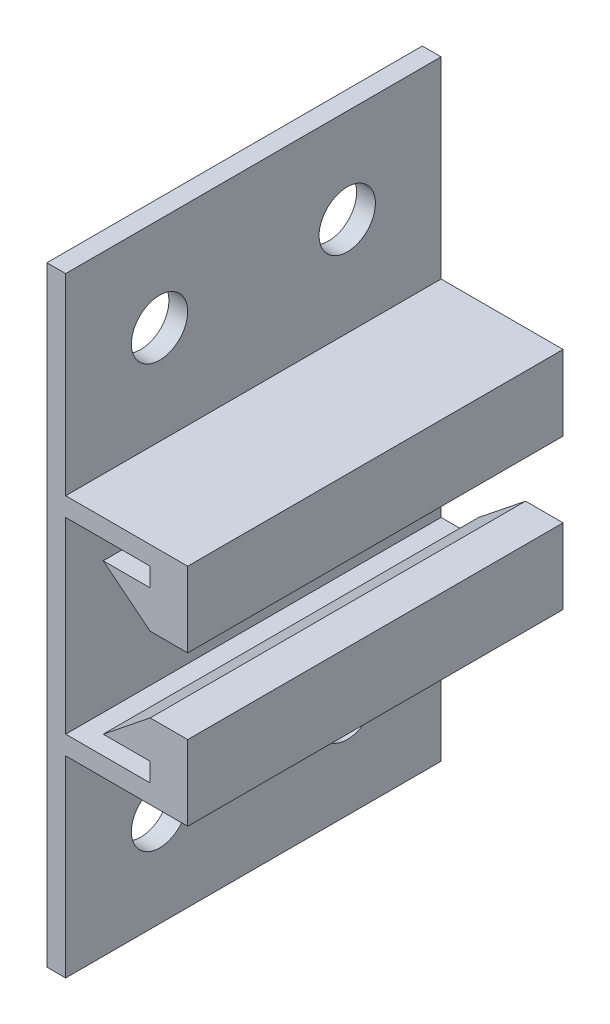
ISO-10303-21;
HEADER;
FILE_DESCRIPTION(('STEP AP214'),'2;1');
FILE_NAME('part.step','',(''),(''),'','','');
FILE_SCHEMA(('AUTOMOTIVE_DESIGN { 1 0 10303 214 1 1 1 1 }'));
ENDSEC;
DATA;
#1=APPLICATION_CONTEXT('core data for automotive mechanical design processes');
#2=APPLICATION_PROTOCOL_DEFINITION('international standard','automotive_design',2000,#1);
#3=PRODUCT_CONTEXT('',#1,'mechanical');
#4=PRODUCT('Part','Part','',(#3));
#5=PRODUCT_RELATED_PRODUCT_CATEGORY('part','',(#4));
#6=PRODUCT_DEFINITION_FORMATION('','',#4);
#7=PRODUCT_DEFINITION_CONTEXT('part definition',#1,'design');
#8=PRODUCT_DEFINITION('design','',#6,#7);
#9=PRODUCT_DEFINITION_SHAPE('','',#8);
#10=(LENGTH_UNIT() NAMED_UNIT(*) SI_UNIT(.MILLI.,.METRE.));
#11=(NAMED_UNIT(*) PLANE_ANGLE_UNIT() SI_UNIT($,.RADIAN.));
#12=(NAMED_UNIT(*) SI_UNIT($,.STERADIAN.) SOLID_ANGLE_UNIT());
#13=UNCERTAINTY_MEASURE_WITH_UNIT(LENGTH_MEASURE(1.E-05),#10,'distance_accuracy_value','');
#14=(GEOMETRIC_REPRESENTATION_CONTEXT(3) GLOBAL_UNCERTAINTY_ASSIGNED_CONTEXT((#13)) GLOBAL_UNIT_ASSIGNED_CONTEXT((#10,
#11,#12)) REPRESENTATION_CONTEXT('',''));
#15=CARTESIAN_POINT('',(0.,0.,0.));
#16=DIRECTION('',(0.,0.,1.));
#17=DIRECTION('',(1.,0.,0.));
#18=AXIS2_PLACEMENT_3D('',#15,#16,#17);
#19=CARTESIAN_POINT('',(1.,0.,20.));
#20=DIRECTION('',(0.,1.,0.));
#21=DIRECTION('',(-1.,0.,0.));
#22=AXIS2_PLACEMENT_3D('',#19,#20,#21);
#23=PLANE('',#22);
#24=DIRECTION('',(1.,0.,0.));
#25=VECTOR('',#24,1.);
#26=CARTESIAN_POINT('',(1.,0.,0.));
#27=LINE('',#26,#25);
#28=CARTESIAN_POINT('',(0.,0.,0.));
#29=VERTEX_POINT('',#28);
#30=CARTESIAN_POINT('',(1.,0.,0.));
#31=VERTEX_POINT('',#30);
#32=EDGE_CURVE('E201',#29,#31,#27,.T.);
#33=ORIENTED_EDGE('',*,*,#32,.T.);
#34=DIRECTION('',(0.,0.,-1.));
#35=VECTOR('',#34,1.);
#36=CARTESIAN_POINT('',(1.,0.,20.));
#37=LINE('',#36,#35);
#38=CARTESIAN_POINT('',(1.,0.,20.));
#39=VERTEX_POINT('',#38);
#40=EDGE_CURVE('E11',#39,#31,#37,.T.);
#41=ORIENTED_EDGE('',*,*,#40,.F.);
#42=DIRECTION('',(1.,0.,0.));
#43=VECTOR('',#42,1.);
#44=CARTESIAN_POINT('',(1.,0.,20.));
#45=LINE('',#44,#43);
#46=CARTESIAN_POINT('',(0.,0.,20.));
#47=VERTEX_POINT('',#46);
#48=EDGE_CURVE('E240',#47,#39,#45,.T.);
#49=ORIENTED_EDGE('',*,*,#48,.F.);
#50=DIRECTION('',(0.,0.,-1.));
#51=VECTOR('',#50,1.);
#52=CARTESIAN_POINT('',(0.,0.,20.));
#53=LINE('',#52,#51);
#54=EDGE_CURVE('E197',#47,#29,#53,.T.);
#55=ORIENTED_EDGE('',*,*,#54,.T.);
#56=EDGE_LOOP('',(#33,#41,#49,#55));
#57=FACE_BOUND('',#56,.T.);
#58=ADVANCED_FACE('F33',(#57),#23,.F.);
#59=CARTESIAN_POINT('',(1.,10.25,20.));
#60=DIRECTION('',(-1.,0.,0.));
#61=DIRECTION('',(0.,-1.,0.));
#62=AXIS2_PLACEMENT_3D('',#59,#60,#61);
#63=PLANE('',#62);
#64=CARTESIAN_POINT('',(1.,5.,5.));
#65=DIRECTION('',(1.,0.,0.));
#66=DIRECTION('',(0.,1.,0.));
#67=AXIS2_PLACEMENT_3D('',#64,#65,#66);
#68=CIRCLE('',#67,1.5);
#69=CARTESIAN_POINT('',(1.,6.5,5.));
#70=VERTEX_POINT('',#69);
#71=EDGE_CURVE('E450',#70,#70,#68,.T.);
#72=ORIENTED_EDGE('',*,*,#71,.F.);
#73=EDGE_LOOP('',(#72));
#74=FACE_BOUND('',#73,.T.);
#75=CARTESIAN_POINT('',(1.,5.,15.));
#76=DIRECTION('',(1.,0.,0.));
#77=DIRECTION('',(0.,1.,0.));
#78=AXIS2_PLACEMENT_3D('',#75,#76,#77);
#79=CIRCLE('',#78,1.5);
#80=CARTESIAN_POINT('',(1.,6.5,15.));
#81=VERTEX_POINT('',#80);
#82=EDGE_CURVE('E438',#81,#81,#79,.T.);
#83=ORIENTED_EDGE('',*,*,#82,.F.);
#84=EDGE_LOOP('',(#83));
#85=FACE_BOUND('',#84,.T.);
#86=DIRECTION('',(0.,1.,0.));
#87=VECTOR('',#86,1.);
#88=CARTESIAN_POINT('',(1.,10.25,0.));
#89=LINE('',#88,#87);
#90=CARTESIAN_POINT('',(1.,10.25,0.));
#91=VERTEX_POINT('',#90);
#92=EDGE_CURVE('E204',#31,#91,#89,.T.);
#93=ORIENTED_EDGE('',*,*,#92,.T.);
#94=DIRECTION('',(0.,0.,-1.));
#95=VECTOR('',#94,1.);
#96=CARTESIAN_POINT('',(1.,10.25,20.));
#97=LINE('',#96,#95);
#98=CARTESIAN_POINT('',(1.,10.25,20.));
#99=VERTEX_POINT('',#98);
#100=EDGE_CURVE('E41',#99,#91,#97,.T.);
#101=ORIENTED_EDGE('',*,*,#100,.F.);
#102=DIRECTION('',(0.,1.,0.));
#103=VECTOR('',#102,1.);
#104=CARTESIAN_POINT('',(1.,10.25,20.));
#105=LINE('',#104,#103);
#106=EDGE_CURVE('E128',#39,#99,#105,.T.);
#107=ORIENTED_EDGE('',*,*,#106,.F.);
#108=ORIENTED_EDGE('',*,*,#40,.T.);
#109=EDGE_LOOP('',(#93,#101,#107,#108));
#110=FACE_BOUND('',#109,.T.);
#111=ADVANCED_FACE('F361',(#74,#85,#110),#63,.F.);
#112=CARTESIAN_POINT('',(7.5,10.25,20.));
#113=DIRECTION('',(0.,1.,0.));
#114=DIRECTION('',(-1.,0.,0.));
#115=AXIS2_PLACEMENT_3D('',#112,#113,#114);
#116=PLANE('',#115);
#117=DIRECTION('',(1.,0.,0.));
#118=VECTOR('',#117,1.);
#119=CARTESIAN_POINT('',(7.5,10.25,0.));
#120=LINE('',#119,#118);
#121=CARTESIAN_POINT('',(7.5,10.25,0.));
#122=VERTEX_POINT('',#121);
#123=EDGE_CURVE('E207',#91,#122,#120,.T.);
#124=ORIENTED_EDGE('',*,*,#123,.T.);
#125=DIRECTION('',(0.,0.,-1.));
#126=VECTOR('',#125,1.);
#127=CARTESIAN_POINT('',(7.5,10.25,20.));
#128=LINE('',#127,#126);
#129=CARTESIAN_POINT('',(7.5,10.25,20.));
#130=VERTEX_POINT('',#129);
#131=EDGE_CURVE('E283',#130,#122,#128,.T.);
#132=ORIENTED_EDGE('',*,*,#131,.F.);
#133=DIRECTION('',(1.,0.,0.));
#134=VECTOR('',#133,1.);
#135=CARTESIAN_POINT('',(7.5,10.25,20.));
#136=LINE('',#135,#134);
#137=EDGE_CURVE('E291',#99,#130,#136,.T.);
#138=ORIENTED_EDGE('',*,*,#137,.F.);
#139=ORIENTED_EDGE('',*,*,#100,.T.);
#140=EDGE_LOOP('',(#124,#132,#138,#139));
#141=FACE_BOUND('',#140,.T.);
#142=ADVANCED_FACE('F289',(#141),#116,.F.);
#143=CARTESIAN_POINT('',(7.5,14.25,20.));
#144=DIRECTION('',(-1.,0.,0.));
#145=DIRECTION('',(0.,-1.,0.));
#146=AXIS2_PLACEMENT_3D('',#143,#144,#145);
#147=PLANE('',#146);
#148=DIRECTION('',(0.,1.,0.));
#149=VECTOR('',#148,1.);
#150=CARTESIAN_POINT('',(7.5,14.25,0.));
#151=LINE('',#150,#149);
#152=CARTESIAN_POINT('',(7.5,14.25,0.));
#153=VERTEX_POINT('',#152);
#154=EDGE_CURVE('E209',#122,#153,#151,.T.);
#155=ORIENTED_EDGE('',*,*,#154,.T.);
#156=DIRECTION('',(0.,0.,-1.));
#157=VECTOR('',#156,1.);
#158=CARTESIAN_POINT('',(7.5,14.25,20.));
#159=LINE('',#158,#157);
#160=CARTESIAN_POINT('',(7.5,14.25,20.));
#161=VERTEX_POINT('',#160);
#162=EDGE_CURVE('E280',#161,#153,#159,.T.);
#163=ORIENTED_EDGE('',*,*,#162,.F.);
#164=DIRECTION('',(0.,1.,0.));
#165=VECTOR('',#164,1.);
#166=CARTESIAN_POINT('',(7.5,14.25,20.));
#167=LINE('',#166,#165);
#168=EDGE_CURVE('E309',#130,#161,#167,.T.);
#169=ORIENTED_EDGE('',*,*,#168,.F.);
#170=ORIENTED_EDGE('',*,*,#131,.T.);
#171=EDGE_LOOP('',(#155,#163,#169,#170));
#172=FACE_BOUND('',#171,.T.);
#173=ADVANCED_FACE('F300',(#172),#147,.F.);
#174=CARTESIAN_POINT('',(5.5,14.25,20.));
#175=DIRECTION('',(0.,-1.,0.));
#176=DIRECTION('',(0.,0.,-1.));
#177=AXIS2_PLACEMENT_3D('',#174,#175,#176);
#178=PLANE('',#177);
#179=DIRECTION('',(-1.,0.,0.));
#180=VECTOR('',#179,1.);
#181=CARTESIAN_POINT('',(5.5,14.25,0.));
#182=LINE('',#181,#180);
#183=CARTESIAN_POINT('',(5.5,14.25,0.));
#184=VERTEX_POINT('',#183);
#185=EDGE_CURVE('E211',#153,#184,#182,.T.);
#186=ORIENTED_EDGE('',*,*,#185,.T.);
#187=DIRECTION('',(0.,0.,-1.));
#188=VECTOR('',#187,1.);
#189=CARTESIAN_POINT('',(5.5,14.25,20.));
#190=LINE('',#189,#188);
#191=CARTESIAN_POINT('',(5.5,14.25,20.));
#192=VERTEX_POINT('',#191);
#193=EDGE_CURVE('E277',#192,#184,#190,.T.);
#194=ORIENTED_EDGE('',*,*,#193,.F.);
#195=DIRECTION('',(-1.,0.,0.));
#196=VECTOR('',#195,1.);
#197=CARTESIAN_POINT('',(5.5,14.25,20.));
#198=LINE('',#197,#196);
#199=EDGE_CURVE('E306',#161,#192,#198,.T.);
#200=ORIENTED_EDGE('',*,*,#199,.F.);
#201=ORIENTED_EDGE('',*,*,#162,.T.);
#202=EDGE_LOOP('',(#186,#194,#200,#201));
#203=FACE_BOUND('',#202,.T.);
#204=ADVANCED_FACE('F304',(#203),#178,.F.);
#205=CARTESIAN_POINT('',(3.,12.25,20.));
#206=DIRECTION('',(0.624695047554424,-0.780868809443031,0.));
#207=DIRECTION('',(0.780868809443031,0.624695047554424,0.));
#208=AXIS2_PLACEMENT_3D('',#205,#206,#207);
#209=PLANE('',#208);
#210=DIRECTION('',(-0.780868809443031,-0.624695047554424,0.));
#211=VECTOR('',#210,1.);
#212=CARTESIAN_POINT('',(3.,12.25,0.));
#213=LINE('',#212,#211);
#214=CARTESIAN_POINT('',(3.,12.25,0.));
#215=VERTEX_POINT('',#214);
#216=EDGE_CURVE('E213',#184,#215,#213,.T.);
#217=ORIENTED_EDGE('',*,*,#216,.T.);
#218=DIRECTION('',(0.,0.,-1.));
#219=VECTOR('',#218,1.);
#220=CARTESIAN_POINT('',(3.,12.25,20.));
#221=LINE('',#220,#219);
#222=CARTESIAN_POINT('',(3.,12.25,20.));
#223=VERTEX_POINT('',#222);
#224=EDGE_CURVE('E274',#223,#215,#221,.T.);
#225=ORIENTED_EDGE('',*,*,#224,.F.);
#226=DIRECTION('',(-0.780868809443031,-0.624695047554424,0.));
#227=VECTOR('',#226,1.);
#228=CARTESIAN_POINT('',(3.,12.25,20.));
#229=LINE('',#228,#227);
#230=EDGE_CURVE('E308',#192,#223,#229,.T.);
#231=ORIENTED_EDGE('',*,*,#230,.F.);
#232=ORIENTED_EDGE('',*,*,#193,.T.);
#233=EDGE_LOOP('',(#217,#225,#231,#232));
#234=FACE_BOUND('',#233,.T.);
#235=ADVANCED_FACE('F377',(#234),#209,.F.);
#236=CARTESIAN_POINT('',(5.5,12.25,20.));
#237=DIRECTION('',(0.,1.,0.));
#238=DIRECTION('',(-1.,0.,0.));
#239=AXIS2_PLACEMENT_3D('',#236,#237,#238);
#240=PLANE('',#239);
#241=DIRECTION('',(1.,0.,0.));
#242=VECTOR('',#241,1.);
#243=CARTESIAN_POINT('',(5.5,12.25,0.));
#244=LINE('',#243,#242);
#245=CARTESIAN_POINT('',(5.5,12.25,0.));
#246=VERTEX_POINT('',#245);
#247=EDGE_CURVE('E215',#215,#246,#244,.T.);
#248=ORIENTED_EDGE('',*,*,#247,.T.);
#249=DIRECTION('',(0.,0.,-1.));
#250=VECTOR('',#249,1.);
#251=CARTESIAN_POINT('',(5.5,12.25,20.));
#252=LINE('',#251,#250);
#253=CARTESIAN_POINT('',(5.5,12.25,20.));
#254=VERTEX_POINT('',#253);
#255=EDGE_CURVE('E271',#254,#246,#252,.T.);
#256=ORIENTED_EDGE('',*,*,#255,.F.);
#257=DIRECTION('',(1.,0.,0.));
#258=VECTOR('',#257,1.);
#259=CARTESIAN_POINT('',(5.5,12.25,20.));
#260=LINE('',#259,#258);
#261=EDGE_CURVE('E311',#223,#254,#260,.T.);
#262=ORIENTED_EDGE('',*,*,#261,.F.);
#263=ORIENTED_EDGE('',*,*,#224,.T.);
#264=EDGE_LOOP('',(#248,#256,#262,#263));
#265=FACE_BOUND('',#264,.T.);
#266=ADVANCED_FACE('F380',(#265),#240,.F.);
#267=CARTESIAN_POINT('',(5.5,11.25,20.));
#268=DIRECTION('',(1.,0.,0.));
#269=DIRECTION('',(0.,1.,0.));
#270=AXIS2_PLACEMENT_3D('',#267,#268,#269);
#271=PLANE('',#270);
#272=DIRECTION('',(0.,-1.,0.));
#273=VECTOR('',#272,1.);
#274=CARTESIAN_POINT('',(5.5,11.25,0.));
#275=LINE('',#274,#273);
#276=CARTESIAN_POINT('',(5.5,11.25,0.));
#277=VERTEX_POINT('',#276);
#278=EDGE_CURVE('E217',#246,#277,#275,.T.);
#279=ORIENTED_EDGE('',*,*,#278,.T.);
#280=DIRECTION('',(0.,0.,-1.));
#281=VECTOR('',#280,1.);
#282=CARTESIAN_POINT('',(5.5,11.25,20.));
#283=LINE('',#282,#281);
#284=CARTESIAN_POINT('',(5.5,11.25,20.));
#285=VERTEX_POINT('',#284);
#286=EDGE_CURVE('E268',#285,#277,#283,.T.);
#287=ORIENTED_EDGE('',*,*,#286,.F.);
#288=DIRECTION('',(0.,-1.,0.));
#289=VECTOR('',#288,1.);
#290=CARTESIAN_POINT('',(5.5,11.25,20.));
#291=LINE('',#290,#289);
#292=EDGE_CURVE('E317',#254,#285,#291,.T.);
#293=ORIENTED_EDGE('',*,*,#292,.F.);
#294=ORIENTED_EDGE('',*,*,#255,.T.);
#295=EDGE_LOOP('',(#279,#287,#293,#294));
#296=FACE_BOUND('',#295,.T.);
#297=ADVANCED_FACE('F384',(#296),#271,.F.);
#298=CARTESIAN_POINT('',(1.,11.25,20.));
#299=DIRECTION('',(0.,-1.,0.));
#300=DIRECTION('',(1.,0.,0.));
#301=AXIS2_PLACEMENT_3D('',#298,#299,#300);
#302=PLANE('',#301);
#303=DIRECTION('',(-1.,0.,0.));
#304=VECTOR('',#303,1.);
#305=CARTESIAN_POINT('',(1.,11.25,0.));
#306=LINE('',#305,#304);
#307=CARTESIAN_POINT('',(1.,11.25,0.));
#308=VERTEX_POINT('',#307);
#309=EDGE_CURVE('E219',#277,#308,#306,.T.);
#310=ORIENTED_EDGE('',*,*,#309,.T.);
#311=DIRECTION('',(0.,0.,-1.));
#312=VECTOR('',#311,1.);
#313=CARTESIAN_POINT('',(1.,11.25,20.));
#314=LINE('',#313,#312);
#315=CARTESIAN_POINT('',(1.,11.25,20.));
#316=VERTEX_POINT('',#315);
#317=EDGE_CURVE('E265',#316,#308,#314,.T.);
#318=ORIENTED_EDGE('',*,*,#317,.F.);
#319=DIRECTION('',(-1.,0.,0.));
#320=VECTOR('',#319,1.);
#321=CARTESIAN_POINT('',(1.,11.25,20.));
#322=LINE('',#321,#320);
#323=EDGE_CURVE('E319',#285,#316,#322,.T.);
#324=ORIENTED_EDGE('',*,*,#323,.F.);
#325=ORIENTED_EDGE('',*,*,#286,.T.);
#326=EDGE_LOOP('',(#310,#318,#324,#325));
#327=FACE_BOUND('',#326,.T.);
#328=ADVANCED_FACE('F388',(#327),#302,.F.);
#329=CARTESIAN_POINT('',(1.,21.25,20.));
#330=DIRECTION('',(-1.,0.,0.));
#331=DIRECTION('',(0.,0.,1.));
#332=AXIS2_PLACEMENT_3D('',#329,#330,#331);
#333=PLANE('',#332);
#334=DIRECTION('',(0.,1.,0.));
#335=VECTOR('',#334,1.);
#336=CARTESIAN_POINT('',(1.,21.25,0.));
#337=LINE('',#336,#335);
#338=CARTESIAN_POINT('',(1.,21.25,0.));
#339=VERTEX_POINT('',#338);
#340=EDGE_CURVE('E221',#308,#339,#337,.T.);
#341=ORIENTED_EDGE('',*,*,#340,.T.);
#342=DIRECTION('',(0.,0.,-1.));
#343=VECTOR('',#342,1.);
#344=CARTESIAN_POINT('',(1.,21.25,20.));
#345=LINE('',#344,#343);
#346=CARTESIAN_POINT('',(1.,21.25,20.));
#347=VERTEX_POINT('',#346);
#348=EDGE_CURVE('E262',#347,#339,#345,.T.);
#349=ORIENTED_EDGE('',*,*,#348,.F.);
#350=DIRECTION('',(0.,1.,0.));
#351=VECTOR('',#350,1.);
#352=CARTESIAN_POINT('',(1.,21.25,20.));
#353=LINE('',#352,#351);
#354=EDGE_CURVE('E321',#316,#347,#353,.T.);
#355=ORIENTED_EDGE('',*,*,#354,.F.);
#356=ORIENTED_EDGE('',*,*,#317,.T.);
#357=EDGE_LOOP('',(#341,#349,#355,#356));
#358=FACE_BOUND('',#357,.T.);
#359=ADVANCED_FACE('F392',(#358),#333,.F.);
#360=CARTESIAN_POINT('',(5.5,21.25,20.));
#361=DIRECTION('',(0.,1.,0.));
#362=DIRECTION('',(0.,0.,1.));
#363=AXIS2_PLACEMENT_3D('',#360,#361,#362);
#364=PLANE('',#363);
#365=DIRECTION('',(1.,0.,0.));
#366=VECTOR('',#365,1.);
#367=CARTESIAN_POINT('',(5.5,21.25,0.));
#368=LINE('',#367,#366);
#369=CARTESIAN_POINT('',(5.5,21.25,0.));
#370=VERTEX_POINT('',#369);
#371=EDGE_CURVE('E223',#339,#370,#368,.T.);
#372=ORIENTED_EDGE('',*,*,#371,.T.);
#373=DIRECTION('',(0.,0.,-1.));
#374=VECTOR('',#373,1.);
#375=CARTESIAN_POINT('',(5.5,21.25,20.));
#376=LINE('',#375,#374);
#377=CARTESIAN_POINT('',(5.5,21.25,20.));
#378=VERTEX_POINT('',#377);
#379=EDGE_CURVE('E259',#378,#370,#376,.T.);
#380=ORIENTED_EDGE('',*,*,#379,.F.);
#381=DIRECTION('',(1.,0.,0.));
#382=VECTOR('',#381,1.);
#383=CARTESIAN_POINT('',(5.5,21.25,20.));
#384=LINE('',#383,#382);
#385=EDGE_CURVE('E323',#347,#378,#384,.T.);
#386=ORIENTED_EDGE('',*,*,#385,.F.);
#387=ORIENTED_EDGE('',*,*,#348,.T.);
#388=EDGE_LOOP('',(#372,#380,#386,#387));
#389=FACE_BOUND('',#388,.T.);
#390=ADVANCED_FACE('F396',(#389),#364,.F.);
#391=CARTESIAN_POINT('',(5.5,20.25,20.));
#392=DIRECTION('',(1.,0.,0.));
#393=DIRECTION('',(0.,1.,0.));
#394=AXIS2_PLACEMENT_3D('',#391,#392,#393);
#395=PLANE('',#394);
#396=DIRECTION('',(0.,-1.,0.));
#397=VECTOR('',#396,1.);
#398=CARTESIAN_POINT('',(5.5,20.25,0.));
#399=LINE('',#398,#397);
#400=CARTESIAN_POINT('',(5.5,20.25,0.));
#401=VERTEX_POINT('',#400);
#402=EDGE_CURVE('E225',#370,#401,#399,.T.);
#403=ORIENTED_EDGE('',*,*,#402,.T.);
#404=DIRECTION('',(0.,0.,-1.));
#405=VECTOR('',#404,1.);
#406=CARTESIAN_POINT('',(5.5,20.25,20.));
#407=LINE('',#406,#405);
#408=CARTESIAN_POINT('',(5.5,20.25,20.));
#409=VERTEX_POINT('',#408);
#410=EDGE_CURVE('E256',#409,#401,#407,.T.);
#411=ORIENTED_EDGE('',*,*,#410,.F.);
#412=DIRECTION('',(0.,-1.,0.));
#413=VECTOR('',#412,1.);
#414=CARTESIAN_POINT('',(5.5,20.25,20.));
#415=LINE('',#414,#413);
#416=EDGE_CURVE('E325',#378,#409,#415,.T.);
#417=ORIENTED_EDGE('',*,*,#416,.F.);
#418=ORIENTED_EDGE('',*,*,#379,.T.);
#419=EDGE_LOOP('',(#403,#411,#417,#418));
#420=FACE_BOUND('',#419,.T.);
#421=ADVANCED_FACE('F400',(#420),#395,.F.);
#422=CARTESIAN_POINT('',(3.,20.25,20.));
#423=DIRECTION('',(0.,-1.,0.));
#424=DIRECTION('',(1.,0.,0.));
#425=AXIS2_PLACEMENT_3D('',#422,#423,#424);
#426=PLANE('',#425);
#427=DIRECTION('',(-1.,0.,0.));
#428=VECTOR('',#427,1.);
#429=CARTESIAN_POINT('',(3.,20.25,0.));
#430=LINE('',#429,#428);
#431=CARTESIAN_POINT('',(3.,20.25,0.));
#432=VERTEX_POINT('',#431);
#433=EDGE_CURVE('E227',#401,#432,#430,.T.);
#434=ORIENTED_EDGE('',*,*,#433,.T.);
#435=DIRECTION('',(0.,0.,-1.));
#436=VECTOR('',#435,1.);
#437=CARTESIAN_POINT('',(3.,20.25,20.));
#438=LINE('',#437,#436);
#439=CARTESIAN_POINT('',(3.,20.25,20.));
#440=VERTEX_POINT('',#439);
#441=EDGE_CURVE('E253',#440,#432,#438,.T.);
#442=ORIENTED_EDGE('',*,*,#441,.F.);
#443=DIRECTION('',(-1.,0.,0.));
#444=VECTOR('',#443,1.);
#445=CARTESIAN_POINT('',(3.,20.25,20.));
#446=LINE('',#445,#444);
#447=EDGE_CURVE('E327',#409,#440,#446,.T.);
#448=ORIENTED_EDGE('',*,*,#447,.F.);
#449=ORIENTED_EDGE('',*,*,#410,.T.);
#450=EDGE_LOOP('',(#434,#442,#448,#449));
#451=FACE_BOUND('',#450,.T.);
#452=ADVANCED_FACE('F404',(#451),#426,.F.);
#453=CARTESIAN_POINT('',(5.5,18.25,20.));
#454=DIRECTION('',(0.624695047554424,0.78086880944303,0.));
#455=DIRECTION('',(-0.78086880944303,0.624695047554424,0.));
#456=AXIS2_PLACEMENT_3D('',#453,#454,#455);
#457=PLANE('',#456);
#458=DIRECTION('',(0.78086880944303,-0.624695047554424,0.));
#459=VECTOR('',#458,1.);
#460=CARTESIAN_POINT('',(5.5,18.25,0.));
#461=LINE('',#460,#459);
#462=CARTESIAN_POINT('',(5.5,18.25,0.));
#463=VERTEX_POINT('',#462);
#464=EDGE_CURVE('E229',#432,#463,#461,.T.);
#465=ORIENTED_EDGE('',*,*,#464,.T.);
#466=DIRECTION('',(0.,0.,-1.));
#467=VECTOR('',#466,1.);
#468=CARTESIAN_POINT('',(5.5,18.25,20.));
#469=LINE('',#468,#467);
#470=CARTESIAN_POINT('',(5.5,18.25,20.));
#471=VERTEX_POINT('',#470);
#472=EDGE_CURVE('E250',#471,#463,#469,.T.);
#473=ORIENTED_EDGE('',*,*,#472,.F.);
#474=DIRECTION('',(0.78086880944303,-0.624695047554424,0.));
#475=VECTOR('',#474,1.);
#476=CARTESIAN_POINT('',(5.5,18.25,20.));
#477=LINE('',#476,#475);
#478=EDGE_CURVE('E329',#440,#471,#477,.T.);
#479=ORIENTED_EDGE('',*,*,#478,.F.);
#480=ORIENTED_EDGE('',*,*,#441,.T.);
#481=EDGE_LOOP('',(#465,#473,#479,#480));
#482=FACE_BOUND('',#481,.T.);
#483=ADVANCED_FACE('F408',(#482),#457,.F.);
#484=CARTESIAN_POINT('',(7.5,18.25,20.));
#485=DIRECTION('',(0.,1.,0.));
#486=DIRECTION('',(0.,0.,1.));
#487=AXIS2_PLACEMENT_3D('',#484,#485,#486);
#488=PLANE('',#487);
#489=DIRECTION('',(1.,0.,0.));
#490=VECTOR('',#489,1.);
#491=CARTESIAN_POINT('',(7.5,18.25,0.));
#492=LINE('',#491,#490);
#493=CARTESIAN_POINT('',(7.5,18.25,0.));
#494=VERTEX_POINT('',#493);
#495=EDGE_CURVE('E231',#463,#494,#492,.T.);
#496=ORIENTED_EDGE('',*,*,#495,.T.);
#497=DIRECTION('',(0.,0.,-1.));
#498=VECTOR('',#497,1.);
#499=CARTESIAN_POINT('',(7.5,18.25,20.));
#500=LINE('',#499,#498);
#501=CARTESIAN_POINT('',(7.5,18.25,20.));
#502=VERTEX_POINT('',#501);
#503=EDGE_CURVE('E247',#502,#494,#500,.T.);
#504=ORIENTED_EDGE('',*,*,#503,.F.);
#505=DIRECTION('',(1.,0.,0.));
#506=VECTOR('',#505,1.);
#507=CARTESIAN_POINT('',(7.5,18.25,20.));
#508=LINE('',#507,#506);
#509=EDGE_CURVE('E331',#471,#502,#508,.T.);
#510=ORIENTED_EDGE('',*,*,#509,.F.);
#511=ORIENTED_EDGE('',*,*,#472,.T.);
#512=EDGE_LOOP('',(#496,#504,#510,#511));
#513=FACE_BOUND('',#512,.T.);
#514=ADVANCED_FACE('F412',(#513),#488,.F.);
#515=CARTESIAN_POINT('',(7.5,22.25,20.));
#516=DIRECTION('',(-1.,0.,0.));
#517=DIRECTION('',(0.,0.,1.));
#518=AXIS2_PLACEMENT_3D('',#515,#516,#517);
#519=PLANE('',#518);
#520=DIRECTION('',(0.,1.,0.));
#521=VECTOR('',#520,1.);
#522=CARTESIAN_POINT('',(7.5,22.25,0.));
#523=LINE('',#522,#521);
#524=CARTESIAN_POINT('',(7.5,22.25,0.));
#525=VERTEX_POINT('',#524);
#526=EDGE_CURVE('E233',#494,#525,#523,.T.);
#527=ORIENTED_EDGE('',*,*,#526,.T.);
#528=DIRECTION('',(0.,0.,-1.));
#529=VECTOR('',#528,1.);
#530=CARTESIAN_POINT('',(7.5,22.25,20.));
#531=LINE('',#530,#529);
#532=CARTESIAN_POINT('',(7.5,22.25,20.));
#533=VERTEX_POINT('',#532);
#534=EDGE_CURVE('E244',#533,#525,#531,.T.);
#535=ORIENTED_EDGE('',*,*,#534,.F.);
#536=DIRECTION('',(0.,1.,0.));
#537=VECTOR('',#536,1.);
#538=CARTESIAN_POINT('',(7.5,22.25,20.));
#539=LINE('',#538,#537);
#540=EDGE_CURVE('E333',#502,#533,#539,.T.);
#541=ORIENTED_EDGE('',*,*,#540,.F.);
#542=ORIENTED_EDGE('',*,*,#503,.T.);
#543=EDGE_LOOP('',(#527,#535,#541,#542));
#544=FACE_BOUND('',#543,.T.);
#545=ADVANCED_FACE('F339',(#544),#519,.F.);
#546=CARTESIAN_POINT('',(1.,22.25,20.));
#547=DIRECTION('',(0.,-1.,0.));
#548=DIRECTION('',(1.,0.,0.));
#549=AXIS2_PLACEMENT_3D('',#546,#547,#548);
#550=PLANE('',#549);
#551=DIRECTION('',(-1.,0.,0.));
#552=VECTOR('',#551,1.);
#553=CARTESIAN_POINT('',(1.,22.25,0.));
#554=LINE('',#553,#552);
#555=CARTESIAN_POINT('',(1.,22.25,0.));
#556=VERTEX_POINT('',#555);
#557=EDGE_CURVE('E235',#525,#556,#554,.T.);
#558=ORIENTED_EDGE('',*,*,#557,.T.);
#559=DIRECTION('',(0.,0.,-1.));
#560=VECTOR('',#559,1.);
#561=CARTESIAN_POINT('',(1.,22.25,20.));
#562=LINE('',#561,#560);
#563=CARTESIAN_POINT('',(1.,22.25,20.));
#564=VERTEX_POINT('',#563);
#565=EDGE_CURVE('E192',#564,#556,#562,.T.);
#566=ORIENTED_EDGE('',*,*,#565,.F.);
#567=DIRECTION('',(-1.,0.,0.));
#568=VECTOR('',#567,1.);
#569=CARTESIAN_POINT('',(1.,22.25,20.));
#570=LINE('',#569,#568);
#571=EDGE_CURVE('E183',#533,#564,#570,.T.);
#572=ORIENTED_EDGE('',*,*,#571,.F.);
#573=ORIENTED_EDGE('',*,*,#534,.T.);
#574=EDGE_LOOP('',(#558,#566,#572,#573));
#575=FACE_BOUND('',#574,.T.);
#576=ADVANCED_FACE('F343',(#575),#550,.F.);
#577=CARTESIAN_POINT('',(0.999999999999999,32.5,20.));
#578=DIRECTION('',(-1.,0.,0.));
#579=DIRECTION('',(0.,-1.,0.));
#580=AXIS2_PLACEMENT_3D('',#577,#578,#579);
#581=PLANE('',#580);
#582=CARTESIAN_POINT('',(1.,27.5,5.));
#583=DIRECTION('',(1.,0.,0.));
#584=DIRECTION('',(0.,1.,0.));
#585=AXIS2_PLACEMENT_3D('',#582,#583,#584);
#586=CIRCLE('',#585,1.5);
#587=CARTESIAN_POINT('',(0.999999999999999,29.,5.));
#588=VERTEX_POINT('',#587);
#589=EDGE_CURVE('E428',#588,#588,#586,.T.);
#590=ORIENTED_EDGE('',*,*,#589,.F.);
#591=EDGE_LOOP('',(#590));
#592=FACE_BOUND('',#591,.T.);
#593=CARTESIAN_POINT('',(1.,27.5,15.));
#594=DIRECTION('',(1.,0.,0.));
#595=DIRECTION('',(0.,1.,0.));
#596=AXIS2_PLACEMENT_3D('',#593,#594,#595);
#597=CIRCLE('',#596,1.5);
#598=CARTESIAN_POINT('',(0.999999999999999,29.,15.));
#599=VERTEX_POINT('',#598);
#600=EDGE_CURVE('E431',#599,#599,#597,.T.);
#601=ORIENTED_EDGE('',*,*,#600,.F.);
#602=EDGE_LOOP('',(#601));
#603=FACE_BOUND('',#602,.T.);
#604=DIRECTION('',(0.,1.,0.));
#605=VECTOR('',#604,1.);
#606=CARTESIAN_POINT('',(0.999999999999999,32.5,0.));
#607=LINE('',#606,#605);
#608=CARTESIAN_POINT('',(0.999999999999999,32.5,0.));
#609=VERTEX_POINT('',#608);
#610=EDGE_CURVE('E191',#556,#609,#607,.T.);
#611=ORIENTED_EDGE('',*,*,#610,.T.);
#612=DIRECTION('',(0.,0.,-1.));
#613=VECTOR('',#612,1.);
#614=CARTESIAN_POINT('',(0.999999999999999,32.5,20.));
#615=LINE('',#614,#613);
#616=CARTESIAN_POINT('',(0.999999999999999,32.5,20.));
#617=VERTEX_POINT('',#616);
#618=EDGE_CURVE('E188',#617,#609,#615,.T.);
#619=ORIENTED_EDGE('',*,*,#618,.F.);
#620=DIRECTION('',(0.,1.,0.));
#621=VECTOR('',#620,1.);
#622=CARTESIAN_POINT('',(0.999999999999999,32.5,20.));
#623=LINE('',#622,#621);
#624=EDGE_CURVE('E177',#564,#617,#623,.T.);
#625=ORIENTED_EDGE('',*,*,#624,.F.);
#626=ORIENTED_EDGE('',*,*,#565,.T.);
#627=EDGE_LOOP('',(#611,#619,#625,#626));
#628=FACE_BOUND('',#627,.T.);
#629=ADVANCED_FACE('F189',(#592,#603,#628),#581,.F.);
#630=CARTESIAN_POINT('',(0.999999999999999,32.5,20.));
#631=DIRECTION('',(0.,-1.,0.));
#632=DIRECTION('',(0.,0.,-1.));
#633=AXIS2_PLACEMENT_3D('',#630,#631,#632);
#634=PLANE('',#633);
#635=DIRECTION('',(-1.,0.,0.));
#636=VECTOR('',#635,1.);
#637=CARTESIAN_POINT('',(0.999999999999999,32.5,0.));
#638=LINE('',#637,#636);
#639=CARTESIAN_POINT('',(0.,32.5,0.));
#640=VERTEX_POINT('',#639);
#641=EDGE_CURVE('E114',#609,#640,#638,.T.);
#642=ORIENTED_EDGE('',*,*,#641,.T.);
#643=DIRECTION('',(0.,0.,-1.));
#644=VECTOR('',#643,1.);
#645=CARTESIAN_POINT('',(0.,32.5,20.));
#646=LINE('',#645,#644);
#647=CARTESIAN_POINT('',(0.,32.5,20.));
#648=VERTEX_POINT('',#647);
#649=EDGE_CURVE('E193',#648,#640,#646,.T.);
#650=ORIENTED_EDGE('',*,*,#649,.F.);
#651=DIRECTION('',(-1.,0.,0.));
#652=VECTOR('',#651,1.);
#653=CARTESIAN_POINT('',(0.999999999999999,32.5,20.));
#654=LINE('',#653,#652);
#655=EDGE_CURVE('E181',#617,#648,#654,.T.);
#656=ORIENTED_EDGE('',*,*,#655,.F.);
#657=ORIENTED_EDGE('',*,*,#618,.T.);
#658=EDGE_LOOP('',(#642,#650,#656,#657));
#659=FACE_BOUND('',#658,.T.);
#660=ADVANCED_FACE('F195',(#659),#634,.F.);
#661=CARTESIAN_POINT('',(0.,32.5,20.));
#662=DIRECTION('',(1.,0.,0.));
#663=DIRECTION('',(0.,1.,0.));
#664=AXIS2_PLACEMENT_3D('',#661,#662,#663);
#665=PLANE('',#664);
#666=CARTESIAN_POINT('',(0.,5.,5.));
#667=DIRECTION('',(1.,0.,0.));
#668=DIRECTION('',(0.,1.,0.));
#669=AXIS2_PLACEMENT_3D('',#666,#667,#668);
#670=CIRCLE('',#669,1.5);
#671=CARTESIAN_POINT('',(0.,6.5,5.));
#672=VERTEX_POINT('',#671);
#673=EDGE_CURVE('E447',#672,#672,#670,.T.);
#674=ORIENTED_EDGE('',*,*,#673,.T.);
#675=EDGE_LOOP('',(#674));
#676=FACE_BOUND('',#675,.T.);
#677=CARTESIAN_POINT('',(0.,27.5,5.));
#678=DIRECTION('',(1.,0.,0.));
#679=DIRECTION('',(0.,1.,0.));
#680=AXIS2_PLACEMENT_3D('',#677,#678,#679);
#681=CIRCLE('',#680,1.5);
#682=CARTESIAN_POINT('',(0.,29.,5.));
#683=VERTEX_POINT('',#682);
#684=EDGE_CURVE('E444',#683,#683,#681,.T.);
#685=ORIENTED_EDGE('',*,*,#684,.T.);
#686=EDGE_LOOP('',(#685));
#687=FACE_BOUND('',#686,.T.);
#688=CARTESIAN_POINT('',(0.,5.,15.));
#689=DIRECTION('',(1.,0.,0.));
#690=DIRECTION('',(0.,1.,0.));
#691=AXIS2_PLACEMENT_3D('',#688,#689,#690);
#692=CIRCLE('',#691,1.5);
#693=CARTESIAN_POINT('',(0.,6.5,15.));
#694=VERTEX_POINT('',#693);
#695=EDGE_CURVE('E433',#694,#694,#692,.T.);
#696=ORIENTED_EDGE('',*,*,#695,.T.);
#697=EDGE_LOOP('',(#696));
#698=FACE_BOUND('',#697,.T.);
#699=CARTESIAN_POINT('',(0.,27.5,15.));
#700=DIRECTION('',(1.,0.,0.));
#701=DIRECTION('',(0.,1.,0.));
#702=AXIS2_PLACEMENT_3D('',#699,#700,#701);
#703=CIRCLE('',#702,1.5);
#704=CARTESIAN_POINT('',(0.,29.,15.));
#705=VERTEX_POINT('',#704);
#706=EDGE_CURVE('E205',#705,#705,#703,.T.);
#707=ORIENTED_EDGE('',*,*,#706,.T.);
#708=EDGE_LOOP('',(#707));
#709=FACE_BOUND('',#708,.T.);
#710=DIRECTION('',(0.,-1.,0.));
#711=VECTOR('',#710,1.);
#712=CARTESIAN_POINT('',(0.,32.5,0.));
#713=LINE('',#712,#711);
#714=EDGE_CURVE('E120',#640,#29,#713,.T.);
#715=ORIENTED_EDGE('',*,*,#714,.T.);
#716=ORIENTED_EDGE('',*,*,#54,.F.);
#717=DIRECTION('',(0.,-1.,0.));
#718=VECTOR('',#717,1.);
#719=CARTESIAN_POINT('',(0.,32.5,20.));
#720=LINE('',#719,#718);
#721=EDGE_CURVE('E49',#648,#47,#720,.T.);
#722=ORIENTED_EDGE('',*,*,#721,.F.);
#723=ORIENTED_EDGE('',*,*,#649,.T.);
#724=EDGE_LOOP('',(#715,#716,#722,#723));
#725=FACE_BOUND('',#724,.T.);
#726=ADVANCED_FACE('F347',(#676,#687,#698,#709,#725),#665,.F.);
#727=CARTESIAN_POINT('',(0.,0.,20.));
#728=DIRECTION('',(0.,0.,1.));
#729=DIRECTION('',(1.,0.,0.));
#730=AXIS2_PLACEMENT_3D('',#727,#728,#729);
#731=PLANE('',#730);
#732=ORIENTED_EDGE('',*,*,#48,.T.);
#733=ORIENTED_EDGE('',*,*,#106,.T.);
#734=ORIENTED_EDGE('',*,*,#137,.T.);
#735=ORIENTED_EDGE('',*,*,#168,.T.);
#736=ORIENTED_EDGE('',*,*,#199,.T.);
#737=ORIENTED_EDGE('',*,*,#230,.T.);
#738=ORIENTED_EDGE('',*,*,#261,.T.);
#739=ORIENTED_EDGE('',*,*,#292,.T.);
#740=ORIENTED_EDGE('',*,*,#323,.T.);
#741=ORIENTED_EDGE('',*,*,#354,.T.);
#742=ORIENTED_EDGE('',*,*,#385,.T.);
#743=ORIENTED_EDGE('',*,*,#416,.T.);
#744=ORIENTED_EDGE('',*,*,#447,.T.);
#745=ORIENTED_EDGE('',*,*,#478,.T.);
#746=ORIENTED_EDGE('',*,*,#509,.T.);
#747=ORIENTED_EDGE('',*,*,#540,.T.);
#748=ORIENTED_EDGE('',*,*,#571,.T.);
#749=ORIENTED_EDGE('',*,*,#624,.T.);
#750=ORIENTED_EDGE('',*,*,#655,.T.);
#751=ORIENTED_EDGE('',*,*,#721,.T.);
#752=EDGE_LOOP('',(#732,#733,#734,#735,#736,#737,#738,#739,#740,#741,#742,#743,#744,#745,#746,
#747,#748,#749,#750,#751));
#753=FACE_BOUND('',#752,.T.);
#754=ADVANCED_FACE('F179',(#753),#731,.T.);
#755=CARTESIAN_POINT('',(0.,0.,0.));
#756=DIRECTION('',(0.,0.,1.));
#757=DIRECTION('',(1.,0.,0.));
#758=AXIS2_PLACEMENT_3D('',#755,#756,#757);
#759=PLANE('',#758);
#760=ORIENTED_EDGE('',*,*,#32,.F.);
#761=ORIENTED_EDGE('',*,*,#714,.F.);
#762=ORIENTED_EDGE('',*,*,#641,.F.);
#763=ORIENTED_EDGE('',*,*,#610,.F.);
#764=ORIENTED_EDGE('',*,*,#557,.F.);
#765=ORIENTED_EDGE('',*,*,#526,.F.);
#766=ORIENTED_EDGE('',*,*,#495,.F.);
#767=ORIENTED_EDGE('',*,*,#464,.F.);
#768=ORIENTED_EDGE('',*,*,#433,.F.);
#769=ORIENTED_EDGE('',*,*,#402,.F.);
#770=ORIENTED_EDGE('',*,*,#371,.F.);
#771=ORIENTED_EDGE('',*,*,#340,.F.);
#772=ORIENTED_EDGE('',*,*,#309,.F.);
#773=ORIENTED_EDGE('',*,*,#278,.F.);
#774=ORIENTED_EDGE('',*,*,#247,.F.);
#775=ORIENTED_EDGE('',*,*,#216,.F.);
#776=ORIENTED_EDGE('',*,*,#185,.F.);
#777=ORIENTED_EDGE('',*,*,#154,.F.);
#778=ORIENTED_EDGE('',*,*,#123,.F.);
#779=ORIENTED_EDGE('',*,*,#92,.F.);
#780=EDGE_LOOP('',(#760,#761,#762,#763,#764,#765,#766,#767,#768,#769,#770,#771,#772,#773,#774,
#775,#776,#777,#778,#779));
#781=FACE_BOUND('',#780,.T.);
#782=ADVANCED_FACE('F295',(#781),#759,.F.);
#783=CARTESIAN_POINT('',(0.,27.5,15.));
#784=DIRECTION('',(1.,0.,0.));
#785=DIRECTION('',(0.,1.,0.));
#786=AXIS2_PLACEMENT_3D('',#783,#784,#785);
#787=CYLINDRICAL_SURFACE('',#786,1.5);
#788=ORIENTED_EDGE('',*,*,#706,.F.);
#789=EDGE_LOOP('',(#788));
#790=FACE_BOUND('',#789,.T.);
#791=ORIENTED_EDGE('',*,*,#600,.T.);
#792=EDGE_LOOP('',(#791));
#793=FACE_BOUND('',#792,.T.);
#794=ADVANCED_FACE('F469',(#790,#793),#787,.F.);
#795=CARTESIAN_POINT('',(0.,5.,15.));
#796=DIRECTION('',(1.,0.,0.));
#797=DIRECTION('',(0.,1.,0.));
#798=AXIS2_PLACEMENT_3D('',#795,#796,#797);
#799=CYLINDRICAL_SURFACE('',#798,1.5);
#800=ORIENTED_EDGE('',*,*,#695,.F.);
#801=EDGE_LOOP('',(#800));
#802=FACE_BOUND('',#801,.T.);
#803=ORIENTED_EDGE('',*,*,#82,.T.);
#804=EDGE_LOOP('',(#803));
#805=FACE_BOUND('',#804,.T.);
#806=ADVANCED_FACE('F463',(#802,#805),#799,.F.);
#807=CARTESIAN_POINT('',(0.,27.5,5.));
#808=DIRECTION('',(1.,0.,0.));
#809=DIRECTION('',(0.,1.,0.));
#810=AXIS2_PLACEMENT_3D('',#807,#808,#809);
#811=CYLINDRICAL_SURFACE('',#810,1.5);
#812=ORIENTED_EDGE('',*,*,#684,.F.);
#813=EDGE_LOOP('',(#812));
#814=FACE_BOUND('',#813,.T.);
#815=ORIENTED_EDGE('',*,*,#589,.T.);
#816=EDGE_LOOP('',(#815));
#817=FACE_BOUND('',#816,.T.);
#818=ADVANCED_FACE('F458',(#814,#817),#811,.F.);
#819=CARTESIAN_POINT('',(0.,5.,5.));
#820=DIRECTION('',(1.,0.,0.));
#821=DIRECTION('',(0.,1.,0.));
#822=AXIS2_PLACEMENT_3D('',#819,#820,#821);
#823=CYLINDRICAL_SURFACE('',#822,1.5);
#824=ORIENTED_EDGE('',*,*,#673,.F.);
#825=EDGE_LOOP('',(#824));
#826=FACE_BOUND('',#825,.T.);
#827=ORIENTED_EDGE('',*,*,#71,.T.);
#828=EDGE_LOOP('',(#827));
#829=FACE_BOUND('',#828,.T.);
#830=ADVANCED_FACE('F455',(#826,#829),#823,.F.);
#831=CLOSED_SHELL('',(#58,#111,#142,#173,#204,#235,#266,#297,#328,#359,#390,#421,#452,#483,#514,
#545,#576,#629,#660,#726,#754,#782,#794,#806,#818,#830));
#832=MANIFOLD_SOLID_BREP('B2',#831);
#833=ADVANCED_BREP_SHAPE_REPRESENTATION('',(#18,#832),#14);
#834=SHAPE_DEFINITION_REPRESENTATION(#9,#833);
ENDSEC;
END-ISO-10303-21;
